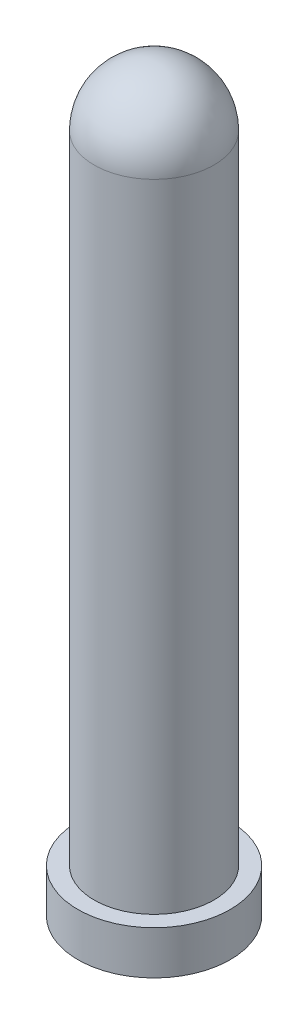
ISO-10303-21;
HEADER;
FILE_DESCRIPTION(('STEP AP214'),'2;1');
FILE_NAME('part.step','',(''),(''),'','','');
FILE_SCHEMA(('AUTOMOTIVE_DESIGN { 1 0 10303 214 1 1 1 1 }'));
ENDSEC;
DATA;
#1=APPLICATION_CONTEXT('core data for automotive mechanical design processes');
#2=APPLICATION_PROTOCOL_DEFINITION('international standard','automotive_design',2000,#1);
#3=PRODUCT_CONTEXT('',#1,'mechanical');
#4=PRODUCT('Part','Part','',(#3));
#5=PRODUCT_RELATED_PRODUCT_CATEGORY('part','',(#4));
#6=PRODUCT_DEFINITION_FORMATION('','',#4);
#7=PRODUCT_DEFINITION_CONTEXT('part definition',#1,'design');
#8=PRODUCT_DEFINITION('design','',#6,#7);
#9=PRODUCT_DEFINITION_SHAPE('','',#8);
#10=(LENGTH_UNIT() NAMED_UNIT(*) SI_UNIT(.MILLI.,.METRE.));
#11=(NAMED_UNIT(*) PLANE_ANGLE_UNIT() SI_UNIT($,.RADIAN.));
#12=(NAMED_UNIT(*) SI_UNIT($,.STERADIAN.) SOLID_ANGLE_UNIT());
#13=UNCERTAINTY_MEASURE_WITH_UNIT(LENGTH_MEASURE(1.E-05),#10,'distance_accuracy_value','');
#14=(GEOMETRIC_REPRESENTATION_CONTEXT(3) GLOBAL_UNCERTAINTY_ASSIGNED_CONTEXT((#13)) GLOBAL_UNIT_ASSIGNED_CONTEXT((#10,
#11,#12)) REPRESENTATION_CONTEXT('',''));
#15=CARTESIAN_POINT('',(0.,0.,0.));
#16=DIRECTION('',(0.,0.,1.));
#17=DIRECTION('',(1.,0.,0.));
#18=AXIS2_PLACEMENT_3D('',#15,#16,#17);
#19=CARTESIAN_POINT('',(-1.5,1.11022302462516E-13,0.));
#20=DIRECTION('',(0.,1.,0.));
#21=DIRECTION('',(0.,0.,1.));
#22=AXIS2_PLACEMENT_3D('',#19,#20,#21);
#23=PLANE('',#22);
#24=CARTESIAN_POINT('',(0.,0.,0.));
#25=DIRECTION('',(0.,-1.,0.));
#26=DIRECTION('',(0.,0.,-1.));
#27=AXIS2_PLACEMENT_3D('',#24,#25,#26);
#28=CIRCLE('',#27,1.5);
#29=CARTESIAN_POINT('',(0.,0.,-1.49999999999999));
#30=VERTEX_POINT('',#29);
#31=EDGE_CURVE('E10',#30,#30,#28,.T.);
#32=ORIENTED_EDGE('',*,*,#31,.F.);
#33=EDGE_LOOP('',(#32));
#34=FACE_BOUND('',#33,.T.);
#35=CARTESIAN_POINT('',(0.,0.,0.));
#36=DIRECTION('',(0.,-1.,0.));
#37=DIRECTION('',(0.,0.,-1.));
#38=AXIS2_PLACEMENT_3D('',#35,#36,#37);
#39=CIRCLE('',#38,3.5);
#40=CARTESIAN_POINT('',(0.,0.,-3.5));
#41=VERTEX_POINT('',#40);
#42=EDGE_CURVE('E46',#41,#41,#39,.T.);
#43=ORIENTED_EDGE('',*,*,#42,.T.);
#44=EDGE_LOOP('',(#43));
#45=FACE_BOUND('',#44,.T.);
#46=ADVANCED_FACE('F24',(#34,#45),#23,.F.);
#47=CARTESIAN_POINT('',(0.,0.,0.));
#48=DIRECTION('',(0.,-1.,0.));
#49=DIRECTION('',(0.,0.,-1.));
#50=AXIS2_PLACEMENT_3D('',#47,#48,#49);
#51=CYLINDRICAL_SURFACE('',#50,1.5);
#52=CARTESIAN_POINT('',(0.,30.0000000000001,0.));
#53=DIRECTION('',(0.,-1.,0.));
#54=DIRECTION('',(0.,0.,-1.));
#55=AXIS2_PLACEMENT_3D('',#52,#53,#54);
#56=CIRCLE('',#55,1.5);
#57=CARTESIAN_POINT('',(0.,30.0000000000001,-1.49999999999999));
#58=VERTEX_POINT('',#57);
#59=EDGE_CURVE('E30',#58,#58,#56,.T.);
#60=ORIENTED_EDGE('',*,*,#59,.F.);
#61=EDGE_LOOP('',(#60));
#62=FACE_BOUND('',#61,.T.);
#63=ORIENTED_EDGE('',*,*,#31,.T.);
#64=EDGE_LOOP('',(#63));
#65=FACE_BOUND('',#64,.T.);
#66=ADVANCED_FACE('F76',(#62,#65),#51,.F.);
#67=CARTESIAN_POINT('',(-1.5,30.,0.));
#68=DIRECTION('',(0.,1.,0.));
#69=DIRECTION('',(0.,0.,1.));
#70=AXIS2_PLACEMENT_3D('',#67,#68,#69);
#71=PLANE('',#70);
#72=ORIENTED_EDGE('',*,*,#59,.T.);
#73=EDGE_LOOP('',(#72));
#74=FACE_BOUND('',#73,.T.);
#75=ADVANCED_FACE('F71',(#74),#71,.F.);
#76=CARTESIAN_POINT('',(0.,31.2500000000001,0.));
#77=DIRECTION('',(0.,-1.,0.));
#78=DIRECTION('',(-1.,0.,0.));
#79=AXIS2_PLACEMENT_3D('',#76,#77,#78);
#80=SPHERICAL_SURFACE('',#79,2.75);
#81=CARTESIAN_POINT('',(0.,31.2500000000001,0.));
#82=DIRECTION('',(0.,-1.,0.));
#83=DIRECTION('',(0.,0.,-1.));
#84=AXIS2_PLACEMENT_3D('',#81,#82,#83);
#85=CIRCLE('',#84,2.75);
#86=CARTESIAN_POINT('',(0.,31.2500000000001,-2.74999999999998));
#87=VERTEX_POINT('',#86);
#88=EDGE_CURVE('E34',#87,#87,#85,.T.);
#89=ORIENTED_EDGE('',*,*,#88,.F.);
#90=EDGE_LOOP('',(#89));
#91=FACE_BOUND('',#90,.T.);
#92=ADVANCED_FACE('F66',(#91),#80,.T.);
#93=CARTESIAN_POINT('',(0.,0.,0.));
#94=DIRECTION('',(0.,-1.,0.));
#95=DIRECTION('',(0.,0.,-1.));
#96=AXIS2_PLACEMENT_3D('',#93,#94,#95);
#97=CYLINDRICAL_SURFACE('',#96,2.75);
#98=CARTESIAN_POINT('',(0.,2.00000000000011,0.));
#99=DIRECTION('',(0.,-1.,0.));
#100=DIRECTION('',(0.,0.,-1.));
#101=AXIS2_PLACEMENT_3D('',#98,#99,#100);
#102=CIRCLE('',#101,2.75);
#103=CARTESIAN_POINT('',(0.,2.00000000000011,-2.74999999999995));
#104=VERTEX_POINT('',#103);
#105=EDGE_CURVE('E38',#104,#104,#102,.T.);
#106=ORIENTED_EDGE('',*,*,#105,.F.);
#107=EDGE_LOOP('',(#106));
#108=FACE_BOUND('',#107,.T.);
#109=ORIENTED_EDGE('',*,*,#88,.T.);
#110=EDGE_LOOP('',(#109));
#111=FACE_BOUND('',#110,.T.);
#112=ADVANCED_FACE('F60',(#108,#111),#97,.T.);
#113=CARTESIAN_POINT('',(-3.49999999999998,2.00000000000011,0.));
#114=DIRECTION('',(0.,-1.,0.));
#115=DIRECTION('',(0.,0.,-1.));
#116=AXIS2_PLACEMENT_3D('',#113,#114,#115);
#117=PLANE('',#116);
#118=CARTESIAN_POINT('',(0.,2.00000000000011,0.));
#119=DIRECTION('',(0.,-1.,0.));
#120=DIRECTION('',(0.,0.,-1.));
#121=AXIS2_PLACEMENT_3D('',#118,#119,#120);
#122=CIRCLE('',#121,3.5);
#123=CARTESIAN_POINT('',(0.,2.00000000000011,-3.49999999999995));
#124=VERTEX_POINT('',#123);
#125=EDGE_CURVE('E43',#124,#124,#122,.T.);
#126=ORIENTED_EDGE('',*,*,#125,.F.);
#127=EDGE_LOOP('',(#126));
#128=FACE_BOUND('',#127,.T.);
#129=ORIENTED_EDGE('',*,*,#105,.T.);
#130=EDGE_LOOP('',(#129));
#131=FACE_BOUND('',#130,.T.);
#132=ADVANCED_FACE('F54',(#128,#131),#117,.F.);
#133=CARTESIAN_POINT('',(0.,0.,0.));
#134=DIRECTION('',(0.,-1.,0.));
#135=DIRECTION('',(0.,0.,-1.));
#136=AXIS2_PLACEMENT_3D('',#133,#134,#135);
#137=CYLINDRICAL_SURFACE('',#136,3.5);
#138=ORIENTED_EDGE('',*,*,#42,.F.);
#139=EDGE_LOOP('',(#138));
#140=FACE_BOUND('',#139,.T.);
#141=ORIENTED_EDGE('',*,*,#125,.T.);
#142=EDGE_LOOP('',(#141));
#143=FACE_BOUND('',#142,.T.);
#144=ADVANCED_FACE('F51',(#140,#143),#137,.T.);
#145=CLOSED_SHELL('',(#46,#66,#75,#92,#112,#132,#144));
#146=MANIFOLD_SOLID_BREP('B2',#145);
#147=ADVANCED_BREP_SHAPE_REPRESENTATION('',(#18,#146),#14);
#148=SHAPE_DEFINITION_REPRESENTATION(#9,#147);
ENDSEC;
END-ISO-10303-21;
